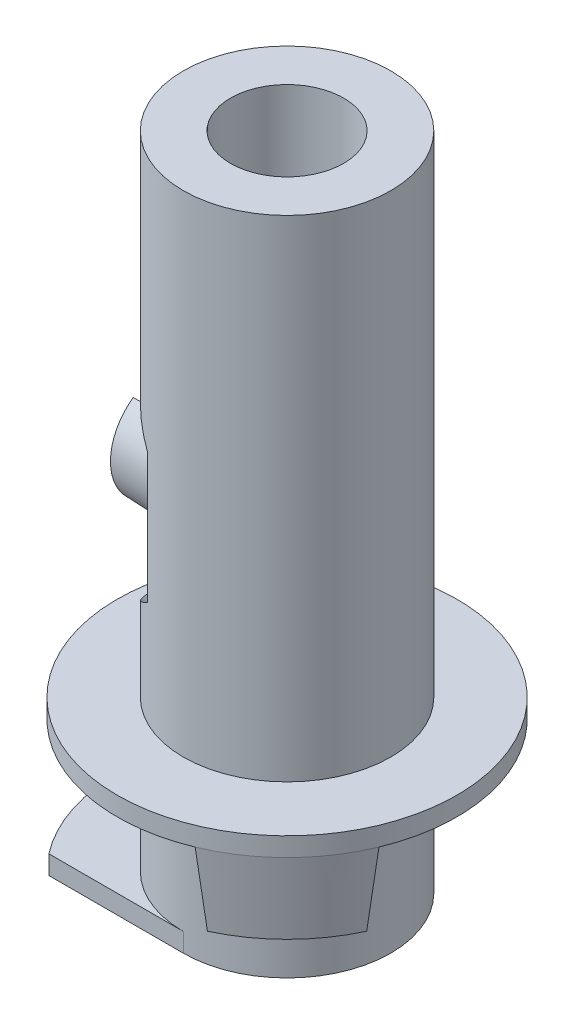
ISO-10303-21;
HEADER;
FILE_DESCRIPTION(('STEP AP214'),'2;1');
FILE_NAME('part.step','',(''),(''),'','','');
FILE_SCHEMA(('AUTOMOTIVE_DESIGN { 1 0 10303 214 1 1 1 1 }'));
ENDSEC;
DATA;
#1=APPLICATION_CONTEXT('core data for automotive mechanical design processes');
#2=APPLICATION_PROTOCOL_DEFINITION('international standard','automotive_design',2000,#1);
#3=PRODUCT_CONTEXT('',#1,'mechanical');
#4=PRODUCT('Part','Part','',(#3));
#5=PRODUCT_RELATED_PRODUCT_CATEGORY('part','',(#4));
#6=PRODUCT_DEFINITION_FORMATION('','',#4);
#7=PRODUCT_DEFINITION_CONTEXT('part definition',#1,'design');
#8=PRODUCT_DEFINITION('design','',#6,#7);
#9=PRODUCT_DEFINITION_SHAPE('','',#8);
#10=(LENGTH_UNIT() NAMED_UNIT(*) SI_UNIT(.MILLI.,.METRE.));
#11=(NAMED_UNIT(*) PLANE_ANGLE_UNIT() SI_UNIT($,.RADIAN.));
#12=(NAMED_UNIT(*) SI_UNIT($,.STERADIAN.) SOLID_ANGLE_UNIT());
#13=UNCERTAINTY_MEASURE_WITH_UNIT(LENGTH_MEASURE(1.E-05),#10,'distance_accuracy_value','');
#14=(GEOMETRIC_REPRESENTATION_CONTEXT(3) GLOBAL_UNCERTAINTY_ASSIGNED_CONTEXT((#13)) GLOBAL_UNIT_ASSIGNED_CONTEXT((#10,
#11,#12)) REPRESENTATION_CONTEXT('',''));
#15=CARTESIAN_POINT('',(0.,0.,0.));
#16=DIRECTION('',(0.,0.,1.));
#17=DIRECTION('',(1.,0.,0.));
#18=AXIS2_PLACEMENT_3D('',#15,#16,#17);
#19=CARTESIAN_POINT('',(-1.25,9.,0.));
#20=DIRECTION('',(1.,0.,0.));
#21=DIRECTION('',(0.,0.,1.));
#22=AXIS2_PLACEMENT_3D('',#19,#20,#21);
#23=CONICAL_SURFACE('',#22,1.5,0.0349065850398867);
#24=CARTESIAN_POINT('',(-3.25,9.,0.));
#25=DIRECTION('',(-1.,0.,0.));
#26=DIRECTION('',(0.,0.,1.));
#27=AXIS2_PLACEMENT_3D('',#24,#25,#26);
#28=CIRCLE('',#27,1.4301584610165);
#29=CARTESIAN_POINT('',(-3.25,7.83473040732324,0.829156197588875));
#30=VERTEX_POINT('',#29);
#31=CARTESIAN_POINT('',(-3.25,10.1652695926768,0.829156197588875));
#32=VERTEX_POINT('',#31);
#33=EDGE_CURVE('E297',#30,#32,#28,.T.);
#34=ORIENTED_EDGE('',*,*,#33,.F.);
#35=CARTESIAN_POINT('',(-5.54773311647972,7.93473777492102,0.829156197588875));
#36=CARTESIAN_POINT('',(-5.0819546412354,7.91412855667914,0.829156197588875));
#37=CARTESIAN_POINT('',(-4.61616648000731,7.89373944782878,0.829156197588875));
#38=CARTESIAN_POINT('',(-3.68457380835907,7.85334350231108,0.829156197588875));
#39=CARTESIAN_POINT('',(-3.21876929794726,7.83333666545131,0.829156197588875));
#40=CARTESIAN_POINT('',(-2.28714654622157,7.79364729942847,0.829156197588875));
#41=CARTESIAN_POINT('',(-1.82132830490961,7.77396477022052,0.829156197588875));
#42=CARTESIAN_POINT('',(-0.889679729064266,7.73488229903319,0.829156197588875));
#43=CARTESIAN_POINT('',(-0.423849394524931,7.71548235719585,0.829156197588875));
#44=CARTESIAN_POINT('',(0.0419859014446088,7.69620286008843,0.829156197588875));
#45=B_SPLINE_CURVE_WITH_KNOTS('',3,(#35,#36,#37,#38,#39,#40,#41,#42,#43,#44),.UNSPECIFIED.,.F.,
.F.,(4,2,2,2,4),(0.,1.39870246719932,2.79740423027038,4.19610579972534,5.59480807211741),.UNSPECIFIED.);
#46=CARTESIAN_POINT('',(-1.25,7.75000000000002,0.829156197588874));
#47=VERTEX_POINT('',#46);
#48=EDGE_CURVE('E260',#30,#47,#45,.T.);
#49=ORIENTED_EDGE('',*,*,#48,.T.);
#50=CARTESIAN_POINT('',(-1.25,9.,0.));
#51=DIRECTION('',(1.,0.,0.));
#52=DIRECTION('',(0.,0.,-1.));
#53=AXIS2_PLACEMENT_3D('',#50,#51,#52);
#54=CIRCLE('',#53,1.5);
#55=CARTESIAN_POINT('',(-1.25,10.25,0.829156197588874));
#56=VERTEX_POINT('',#55);
#57=EDGE_CURVE('E160',#47,#56,#54,.F.);
#58=ORIENTED_EDGE('',*,*,#57,.T.);
#59=CARTESIAN_POINT('',(0.0419859014446088,10.3037971399116,0.829156197588875));
#60=CARTESIAN_POINT('',(-0.423849394524932,10.2845176428042,0.829156197588875));
#61=CARTESIAN_POINT('',(-0.889679729064267,10.2651177009668,0.829156197588875));
#62=CARTESIAN_POINT('',(-1.8213283049096,10.2260352297795,0.829156197588875));
#63=CARTESIAN_POINT('',(-2.28714654622157,10.2063527005715,0.829156197588875));
#64=CARTESIAN_POINT('',(-3.21876929794725,10.1666633345486,0.829156197588875));
#65=CARTESIAN_POINT('',(-3.68457380835907,10.1466564976889,0.829156197588875));
#66=CARTESIAN_POINT('',(-4.61616648000731,10.1062605521713,0.829156197588875));
#67=CARTESIAN_POINT('',(-5.0819546412354,10.0858714433209,0.829156197588875));
#68=CARTESIAN_POINT('',(-5.54773311647972,10.065262225079,0.829156197588875));
#69=B_SPLINE_CURVE_WITH_KNOTS('',3,(#59,#60,#61,#62,#63,#64,#65,#66,#67,#68),.UNSPECIFIED.,.F.,
.F.,(4,2,2,2,4),(0.,1.39870227239207,2.79740384184703,4.19610560491809,5.59480807211741),.UNSPECIFIED.);
#70=EDGE_CURVE('E275',#56,#32,#69,.T.);
#71=ORIENTED_EDGE('',*,*,#70,.T.);
#72=EDGE_LOOP('',(#34,#49,#58,#71));
#73=FACE_BOUND('',#72,.T.);
#74=ADVANCED_FACE('F37',(#73),#23,.T.);
#75=CARTESIAN_POINT('',(-3.25,9.,0.));
#76=DIRECTION('',(-1.,0.,0.));
#77=DIRECTION('',(0.,0.,1.));
#78=AXIS2_PLACEMENT_3D('',#75,#76,#77);
#79=PLANE('',#78);
#80=DIRECTION('',(0.,1.,0.));
#81=VECTOR('',#80,1.);
#82=CARTESIAN_POINT('',(-3.25,10.4912697922836,0.829156197588875));
#83=LINE('',#82,#81);
#84=EDGE_CURVE('E168',#30,#32,#83,.T.);
#85=ORIENTED_EDGE('',*,*,#84,.F.);
#86=ORIENTED_EDGE('',*,*,#33,.T.);
#87=EDGE_LOOP('',(#85,#86));
#88=FACE_BOUND('',#87,.T.);
#89=ADVANCED_FACE('F254',(#88),#79,.T.);
#90=CARTESIAN_POINT('',(-1.25,9.,0.));
#91=DIRECTION('',(1.,0.,0.));
#92=DIRECTION('',(0.,0.,-1.));
#93=AXIS2_PLACEMENT_3D('',#90,#91,#92);
#94=PLANE('',#93);
#95=CARTESIAN_POINT('',(-1.25,9.,0.));
#96=DIRECTION('',(1.,0.,0.));
#97=DIRECTION('',(0.,0.,-1.));
#98=AXIS2_PLACEMENT_3D('',#95,#96,#97);
#99=CIRCLE('',#98,3.);
#100=CARTESIAN_POINT('',(-1.25,6.11685935133231,-0.829156197588875));
#101=VERTEX_POINT('',#100);
#102=CARTESIAN_POINT('',(-1.25,7.26794919243112,-2.44948974278318));
#103=VERTEX_POINT('',#102);
#104=EDGE_CURVE('E300',#101,#103,#99,.T.);
#105=ORIENTED_EDGE('',*,*,#104,.F.);
#106=DIRECTION('',(0.,1.,0.));
#107=VECTOR('',#106,1.);
#108=CARTESIAN_POINT('',(-1.25,17.5,-0.829156197588875));
#109=LINE('',#108,#107);
#110=CARTESIAN_POINT('',(-1.25,7.75000000000002,-0.829156197588874));
#111=VERTEX_POINT('',#110);
#112=EDGE_CURVE('E182',#101,#111,#109,.T.);
#113=ORIENTED_EDGE('',*,*,#112,.T.);
#114=CARTESIAN_POINT('',(-1.25,10.25,-0.829156197588875));
#115=VERTEX_POINT('',#114);
#116=EDGE_CURVE('E165',#115,#111,#54,.F.);
#117=ORIENTED_EDGE('',*,*,#116,.F.);
#118=CARTESIAN_POINT('',(-1.25,11.8831406486677,-0.829156197588875));
#119=VERTEX_POINT('',#118);
#120=EDGE_CURVE('E171',#115,#119,#109,.T.);
#121=ORIENTED_EDGE('',*,*,#120,.T.);
#122=CARTESIAN_POINT('',(-1.25,10.7320508075689,-2.44948974278318));
#123=VERTEX_POINT('',#122);
#124=EDGE_CURVE('E302',#123,#119,#99,.T.);
#125=ORIENTED_EDGE('',*,*,#124,.F.);
#126=DIRECTION('',(0.,1.,0.));
#127=VECTOR('',#126,1.);
#128=CARTESIAN_POINT('',(-1.25,0.,-2.44948974278318));
#129=LINE('',#128,#127);
#130=EDGE_CURVE('E185',#123,#103,#129,.F.);
#131=ORIENTED_EDGE('',*,*,#130,.T.);
#132=EDGE_LOOP('',(#105,#113,#117,#121,#125,#131));
#133=FACE_BOUND('',#132,.T.);
#134=ADVANCED_FACE('F184',(#133),#94,.F.);
#135=CARTESIAN_POINT('',(0.,0.,0.));
#136=DIRECTION('',(0.,1.,0.));
#137=DIRECTION('',(0.,0.,1.));
#138=AXIS2_PLACEMENT_3D('',#135,#136,#137);
#139=CYLINDRICAL_SURFACE('',#138,2.75);
#140=CARTESIAN_POINT('',(0.,4.5,0.));
#141=DIRECTION('',(0.,1.,0.));
#142=DIRECTION('',(0.,0.,1.));
#143=AXIS2_PLACEMENT_3D('',#140,#141,#142);
#144=CIRCLE('',#143,2.75);
#145=CARTESIAN_POINT('',(0.,4.5,2.75));
#146=VERTEX_POINT('',#145);
#147=EDGE_CURVE('E400',#146,#146,#144,.T.);
#148=ORIENTED_EDGE('',*,*,#147,.T.);
#149=EDGE_LOOP('',(#148));
#150=FACE_BOUND('',#149,.T.);
#151=CARTESIAN_POINT('',(0.,17.5,0.));
#152=DIRECTION('',(0.,1.,0.));
#153=DIRECTION('',(0.,0.,1.));
#154=AXIS2_PLACEMENT_3D('',#151,#152,#153);
#155=CIRCLE('',#154,2.75);
#156=CARTESIAN_POINT('',(0.,17.5,2.75));
#157=VERTEX_POINT('',#156);
#158=EDGE_CURVE('E397',#157,#157,#155,.T.);
#159=ORIENTED_EDGE('',*,*,#158,.F.);
#160=EDGE_LOOP('',(#159));
#161=FACE_BOUND('',#160,.T.);
#162=DIRECTION('',(0.,1.,0.));
#163=VECTOR('',#162,1.);
#164=CARTESIAN_POINT('',(-1.25,0.,2.44948974278318));
#165=LINE('',#164,#163);
#166=CARTESIAN_POINT('',(-1.25,7.26794919243112,2.44948974278318));
#167=VERTEX_POINT('',#166);
#168=CARTESIAN_POINT('',(-1.25,10.7320508075689,2.44948974278318));
#169=VERTEX_POINT('',#168);
#170=EDGE_CURVE('E189',#167,#169,#165,.T.);
#171=ORIENTED_EDGE('',*,*,#170,.F.);
#172=CARTESIAN_POINT('',(-1.25,7.26794919243112,2.44948974278318));
#173=CARTESIAN_POINT('',(-1.29360109122252,7.2364696803024,2.42723370605396));
#174=CARTESIAN_POINT('',(-1.33646886510283,7.20475799307902,2.40389651947983));
#175=CARTESIAN_POINT('',(-1.42079406110998,7.14113488651769,2.3550425596927));
#176=CARTESIAN_POINT('',(-1.46225143542518,7.10922346045204,2.32952571269335));
#177=CARTESIAN_POINT('',(-1.58476880063755,7.01344845542112,2.24956414252169));
#178=CARTESIAN_POINT('',(-1.66378122565755,6.94968605273935,2.19180688198788));
#179=CARTESIAN_POINT('',(-1.81702758225269,6.82349126438266,2.0665931907894));
#180=CARTESIAN_POINT('',(-1.89119688384546,6.76108227953949,1.99903384009693));
#181=CARTESIAN_POINT('',(-2.03304768513551,6.64003791929434,1.85457545287197));
#182=CARTESIAN_POINT('',(-2.10073693795824,6.5813980626076,1.7776878335623));
#183=CARTESIAN_POINT('',(-2.2437629753308,6.45628131822538,1.59513202237854));
#184=CARTESIAN_POINT('',(-2.31716105500053,6.39119926644495,1.48694582598197));
#185=CARTESIAN_POINT('',(-2.4495919360588,6.27289087512397,1.25678641241698));
#186=CARTESIAN_POINT('',(-2.50868654695825,6.21961361129784,1.13487597762832));
#187=CARTESIAN_POINT('',(-2.60160008584873,6.13547562958644,0.898700751629193));
#188=CARTESIAN_POINT('',(-2.63792574141932,6.102412920861,0.786218291272837));
#189=CARTESIAN_POINT('',(-2.69615354404084,6.04930512371971,0.554527089967231));
#190=CARTESIAN_POINT('',(-2.71805522743689,6.02926045376564,0.435318132930186));
#191=CARTESIAN_POINT('',(-2.74593654373312,6.00372973635978,0.193008267367081));
#192=CARTESIAN_POINT('',(-2.75185509064452,5.9982995442849,0.0698942414795929));
#193=CARTESIAN_POINT('',(-2.7471263477659,6.00263412336194,-0.175739129092036));
#194=CARTESIAN_POINT('',(-2.73647965557244,6.01239834637023,-0.298258495068787));
#195=CARTESIAN_POINT('',(-2.70068581757648,6.04514694657188,-0.530773316301527));
#196=CARTESIAN_POINT('',(-2.67654827663599,6.06721060697073,-0.641060215336326));
#197=CARTESIAN_POINT('',(-2.61600950057989,6.12235327958093,-0.855212543567005));
#198=CARTESIAN_POINT('',(-2.57961092441018,6.15542990348703,-0.9590793592566));
#199=CARTESIAN_POINT('',(-2.48193315354928,6.24374973693234,-1.19316274162378));
#200=CARTESIAN_POINT('',(-2.41640215513245,6.30270470027457,-1.32020146609323));
#201=CARTESIAN_POINT('',(-2.26995725539269,6.43307983993419,-1.55869354370602));
#202=CARTESIAN_POINT('',(-2.18896921778365,6.50455994919897,-1.67006709749393));
#203=CARTESIAN_POINT('',(-2.04096855220335,6.63311514872375,-1.84550620876404));
#204=CARTESIAN_POINT('',(-1.97701266924504,6.68811107455905,-1.91376275908749));
#205=CARTESIAN_POINT('',(-1.84379788137059,6.80094742095163,-2.04242312424064));
#206=CARTESIAN_POINT('',(-1.77453489426201,6.85879001866764,-2.10282079574128));
#207=CARTESIAN_POINT('',(-1.63201311321895,6.97532840604242,-2.21521483621865));
#208=CARTESIAN_POINT('',(-1.55881051505756,7.03400630965185,-2.26730118708306));
#209=CARTESIAN_POINT('',(-1.44559674452185,7.12205138923085,-2.33981901171704));
#210=CARTESIAN_POINT('',(-1.40731965955976,7.1513830545826,-2.36304144286291));
#211=CARTESIAN_POINT('',(-1.32956877566832,7.20985914790689,-2.40764422011553));
#212=CARTESIAN_POINT('',(-1.29009498536312,7.23900357722692,-2.42902457949307));
#213=CARTESIAN_POINT('',(-1.25,7.26794919243112,-2.44948974278318));
#214=B_SPLINE_CURVE_WITH_KNOTS('',3,(#172,#173,#174,#175,#176,#177,#178,#179,#180,#181,#182,
#183,#184,#185,#186,#187,#188,#189,#190,#191,#192,#193,#194,#195,#196,#197,#198,#199,#200,#201,
#202,#203,#204,#205,#206,#207,#208,#209,#210,#211,#212,#213),.UNSPECIFIED.,.F.,.F.,(4,2,2,2,2,2,
2,2,2,2,2,2,2,2,2,2,2,2,2,2,4),(0.,0.174568213691818,0.349142339249726,0.699064440548584,
1.05296962740488,1.40644594512683,1.8429560716287,2.27754481307969,2.64422002069884,
3.0109070144231,3.37899347977766,3.74706666659737,4.09070363541296,4.43426613054111,
4.89563979561709,5.35928462980441,5.68436721994048,6.00970242151493,6.33123332010189,
6.49176482445276,6.65229517219497),.UNSPECIFIED.);
#215=EDGE_CURVE('E52',#167,#103,#214,.T.);
#216=ORIENTED_EDGE('',*,*,#215,.T.);
#217=ORIENTED_EDGE('',*,*,#130,.F.);
#218=CARTESIAN_POINT('',(-1.25,10.7320508075689,-2.44948974278318));
#219=CARTESIAN_POINT('',(-1.29360109122252,10.7635303196976,-2.42723370605396));
#220=CARTESIAN_POINT('',(-1.33646886510283,10.795242006921,-2.40389651947983));
#221=CARTESIAN_POINT('',(-1.42079406110999,10.8588651134823,-2.3550425596927));
#222=CARTESIAN_POINT('',(-1.46225143542518,10.890776539548,-2.32952571269335));
#223=CARTESIAN_POINT('',(-1.58476880063756,10.9865515445789,-2.24956414252169));
#224=CARTESIAN_POINT('',(-1.66378122565755,11.0503139472607,-2.19180688198788));
#225=CARTESIAN_POINT('',(-1.81702758225269,11.1765087356173,-2.0665931907894));
#226=CARTESIAN_POINT('',(-1.89119688384546,11.2389177204605,-1.99903384009693));
#227=CARTESIAN_POINT('',(-2.03304768513551,11.3599620807057,-1.85457545287197));
#228=CARTESIAN_POINT('',(-2.10073693795824,11.4186019373924,-1.7776878335623));
#229=CARTESIAN_POINT('',(-2.2437629753308,11.5437186817746,-1.59513202237854));
#230=CARTESIAN_POINT('',(-2.31716105500053,11.608800733555,-1.48694582598197));
#231=CARTESIAN_POINT('',(-2.4495919360588,11.727109124876,-1.25678641241698));
#232=CARTESIAN_POINT('',(-2.50868654695825,11.7803863887022,-1.13487597762832));
#233=CARTESIAN_POINT('',(-2.60160008584873,11.8645243704136,-0.898700751629194));
#234=CARTESIAN_POINT('',(-2.63792574141932,11.897587079139,-0.786218291272839));
#235=CARTESIAN_POINT('',(-2.69615354404084,11.9506948762803,-0.554527089967233));
#236=CARTESIAN_POINT('',(-2.71805522743689,11.9707395462344,-0.435318132930187));
#237=CARTESIAN_POINT('',(-2.74593654373312,11.9962702636402,-0.193008267367082));
#238=CARTESIAN_POINT('',(-2.75185509064452,12.0017004557151,-0.0698942414795941));
#239=CARTESIAN_POINT('',(-2.7471263477659,11.9973658766381,0.175739129092035));
#240=CARTESIAN_POINT('',(-2.73647965557244,11.9876016536298,0.298258495068786));
#241=CARTESIAN_POINT('',(-2.70068581757648,11.9548530534281,0.530773316301526));
#242=CARTESIAN_POINT('',(-2.67654827663599,11.9327893930293,0.641060215336325));
#243=CARTESIAN_POINT('',(-2.61600950057989,11.8776467204191,0.855212543567004));
#244=CARTESIAN_POINT('',(-2.57961092441018,11.844570096513,0.9590793592566));
#245=CARTESIAN_POINT('',(-2.48193315354928,11.7562502630677,1.19316274162378));
#246=CARTESIAN_POINT('',(-2.41640215513245,11.6972952997254,1.32020146609323));
#247=CARTESIAN_POINT('',(-2.26995725539269,11.5669201600658,1.55869354370602));
#248=CARTESIAN_POINT('',(-2.18896921778365,11.495440050801,1.67006709749393));
#249=CARTESIAN_POINT('',(-2.04096855220335,11.3668848512763,1.84550620876404));
#250=CARTESIAN_POINT('',(-1.97701266924504,11.311888925441,1.91376275908749));
#251=CARTESIAN_POINT('',(-1.84379788137059,11.1990525790484,2.04242312424064));
#252=CARTESIAN_POINT('',(-1.77453489426201,11.1412099813324,2.10282079574128));
#253=CARTESIAN_POINT('',(-1.63201311321894,11.0246715939576,2.21521483621865));
#254=CARTESIAN_POINT('',(-1.55881051505756,10.9659936903482,2.26730118708306));
#255=CARTESIAN_POINT('',(-1.44559674452185,10.8779486107692,2.33981901171704));
#256=CARTESIAN_POINT('',(-1.40731965955976,10.8486169454174,2.36304144286291));
#257=CARTESIAN_POINT('',(-1.32956877566832,10.7901408520931,2.40764422011554));
#258=CARTESIAN_POINT('',(-1.29009498536312,10.7609964227731,2.42902457949307));
#259=CARTESIAN_POINT('',(-1.25,10.7320508075689,2.44948974278318));
#260=B_SPLINE_CURVE_WITH_KNOTS('',3,(#218,#219,#220,#221,#222,#223,#224,#225,#226,#227,#228,
#229,#230,#231,#232,#233,#234,#235,#236,#237,#238,#239,#240,#241,#242,#243,#244,#245,#246,#247,
#248,#249,#250,#251,#252,#253,#254,#255,#256,#257,#258,#259),.UNSPECIFIED.,.F.,.F.,(4,2,2,2,2,2,
2,2,2,2,2,2,2,2,2,2,2,2,2,2,4),(0.,0.174568213691819,0.349142339249726,0.699064440548583,
1.05296962740487,1.40644594512683,1.8429560716287,2.27754481307969,2.64422002069884,
3.0109070144231,3.37899347977766,3.74706666659736,4.09070363541296,4.43426613054111,
4.89563979561709,5.35928462980441,5.68436721994047,6.00970242151493,6.33123332010189,
6.49176482445276,6.65229517219497),.UNSPECIFIED.);
#261=EDGE_CURVE('E200',#123,#169,#260,.T.);
#262=ORIENTED_EDGE('',*,*,#261,.T.);
#263=EDGE_LOOP('',(#171,#216,#217,#262));
#264=FACE_BOUND('',#263,.T.);
#265=ADVANCED_FACE('F205',(#150,#161,#264),#139,.T.);
#266=CARTESIAN_POINT('',(4.5,4.,0.));
#267=DIRECTION('',(0.,1.,0.));
#268=DIRECTION('',(0.,0.,1.));
#269=AXIS2_PLACEMENT_3D('',#266,#267,#268);
#270=PLANE('',#269);
#271=CARTESIAN_POINT('',(0.,4.,0.));
#272=DIRECTION('',(0.,-1.,0.));
#273=DIRECTION('',(0.,0.,-1.));
#274=AXIS2_PLACEMENT_3D('',#271,#272,#273);
#275=CIRCLE('',#274,2.75);
#276=CARTESIAN_POINT('',(0.,4.,-2.75));
#277=VERTEX_POINT('',#276);
#278=EDGE_CURVE('E390',#277,#277,#275,.T.);
#279=ORIENTED_EDGE('',*,*,#278,.F.);
#280=EDGE_LOOP('',(#279));
#281=FACE_BOUND('',#280,.T.);
#282=DIRECTION('',(-0.382683432365124,0.,-0.923879532511273));
#283=VECTOR('',#282,1.);
#284=CARTESIAN_POINT('',(1.33939201327794,4.,3.23357836378945));
#285=LINE('',#284,#283);
#286=CARTESIAN_POINT('',(1.72207544564306,4.,4.15745789630073));
#287=VERTEX_POINT('',#286);
#288=CARTESIAN_POINT('',(1.33939201327793,4.,3.23357836378945));
#289=VERTEX_POINT('',#288);
#290=EDGE_CURVE('E304',#287,#289,#285,.T.);
#291=ORIENTED_EDGE('',*,*,#290,.F.);
#292=CARTESIAN_POINT('',(0.,4.,0.));
#293=DIRECTION('',(0.,-1.,0.));
#294=DIRECTION('',(0.,0.,-1.));
#295=AXIS2_PLACEMENT_3D('',#292,#293,#294);
#296=CIRCLE('',#295,4.5);
#297=CARTESIAN_POINT('',(4.15745789630086,4.,1.72207544564274));
#298=VERTEX_POINT('',#297);
#299=EDGE_CURVE('E393',#287,#298,#296,.T.);
#300=ORIENTED_EDGE('',*,*,#299,.T.);
#301=DIRECTION('',(0.923879532511301,0.,0.382683432365054));
#302=VECTOR('',#301,1.);
#303=CARTESIAN_POINT('',(3.23357836378955,4.,1.33939201327769));
#304=LINE('',#303,#302);
#305=CARTESIAN_POINT('',(3.23357836378955,4.,1.33939201327769));
#306=VERTEX_POINT('',#305);
#307=EDGE_CURVE('E309',#306,#298,#304,.T.);
#308=ORIENTED_EDGE('',*,*,#307,.F.);
#309=CARTESIAN_POINT('',(0.,4.,0.));
#310=DIRECTION('',(0.,1.,0.));
#311=DIRECTION('',(0.,0.,-1.));
#312=AXIS2_PLACEMENT_3D('',#309,#310,#311);
#313=CIRCLE('',#312,3.5);
#314=EDGE_CURVE('E60',#289,#306,#313,.T.);
#315=ORIENTED_EDGE('',*,*,#314,.F.);
#316=EDGE_LOOP('',(#291,#300,#308,#315));
#317=FACE_BOUND('',#316,.T.);
#318=ADVANCED_FACE('F448',(#281,#317),#270,.F.);
#319=CARTESIAN_POINT('',(0.,17.5,0.));
#320=DIRECTION('',(0.,-1.,0.));
#321=DIRECTION('',(0.,0.,-1.));
#322=AXIS2_PLACEMENT_3D('',#319,#320,#321);
#323=CYLINDRICAL_SURFACE('',#322,4.5);
#324=EDGE_CURVE('E394',#298,#287,#296,.T.);
#325=ORIENTED_EDGE('',*,*,#324,.F.);
#326=ORIENTED_EDGE('',*,*,#299,.F.);
#327=EDGE_LOOP('',(#325,#326));
#328=FACE_BOUND('',#327,.T.);
#329=CARTESIAN_POINT('',(0.,4.5,0.));
#330=DIRECTION('',(0.,1.,0.));
#331=DIRECTION('',(0.,0.,1.));
#332=AXIS2_PLACEMENT_3D('',#329,#330,#331);
#333=CIRCLE('',#332,4.5);
#334=CARTESIAN_POINT('',(0.,4.5,4.5));
#335=VERTEX_POINT('',#334);
#336=EDGE_CURVE('E403',#335,#335,#333,.T.);
#337=ORIENTED_EDGE('',*,*,#336,.F.);
#338=EDGE_LOOP('',(#337));
#339=FACE_BOUND('',#338,.T.);
#340=ADVANCED_FACE('F454',(#328,#339),#323,.T.);
#341=CARTESIAN_POINT('',(4.5,4.5,0.));
#342=DIRECTION('',(0.,1.,0.));
#343=DIRECTION('',(0.,0.,1.));
#344=AXIS2_PLACEMENT_3D('',#341,#342,#343);
#345=PLANE('',#344);
#346=ORIENTED_EDGE('',*,*,#336,.T.);
#347=EDGE_LOOP('',(#346));
#348=FACE_BOUND('',#347,.T.);
#349=ORIENTED_EDGE('',*,*,#147,.F.);
#350=EDGE_LOOP('',(#349));
#351=FACE_BOUND('',#350,.T.);
#352=ADVANCED_FACE('F443',(#348,#351),#345,.T.);
#353=CARTESIAN_POINT('',(0.,17.5,0.));
#354=DIRECTION('',(0.,1.,0.));
#355=DIRECTION('',(0.,0.,1.));
#356=AXIS2_PLACEMENT_3D('',#353,#354,#355);
#357=PLANE('',#356);
#358=CARTESIAN_POINT('',(0.,17.5,0.));
#359=DIRECTION('',(0.,1.,0.));
#360=DIRECTION('',(0.,0.,1.));
#361=AXIS2_PLACEMENT_3D('',#358,#359,#360);
#362=CIRCLE('',#361,1.50000000000002);
#363=CARTESIAN_POINT('',(0.,17.5,1.50000000000002));
#364=VERTEX_POINT('',#363);
#365=EDGE_CURVE('E425',#364,#364,#362,.T.);
#366=ORIENTED_EDGE('',*,*,#365,.F.);
#367=EDGE_LOOP('',(#366));
#368=FACE_BOUND('',#367,.T.);
#369=ORIENTED_EDGE('',*,*,#158,.T.);
#370=EDGE_LOOP('',(#369));
#371=FACE_BOUND('',#370,.T.);
#372=ADVANCED_FACE('F439',(#368,#371),#357,.T.);
#373=CARTESIAN_POINT('',(0.,0.,0.));
#374=DIRECTION('',(0.,-1.,0.));
#375=DIRECTION('',(0.,0.,-1.));
#376=AXIS2_PLACEMENT_3D('',#373,#374,#375);
#377=CYLINDRICAL_SURFACE('',#376,2.75);
#378=CARTESIAN_POINT('',(0.,0.5,0.));
#379=DIRECTION('',(0.,-1.,0.));
#380=DIRECTION('',(0.,0.,-1.));
#381=AXIS2_PLACEMENT_3D('',#378,#379,#380);
#382=CIRCLE('',#381,2.75);
#383=CARTESIAN_POINT('',(0.,0.5,2.75));
#384=VERTEX_POINT('',#383);
#385=CARTESIAN_POINT('',(0.,0.5,-2.75));
#386=VERTEX_POINT('',#385);
#387=EDGE_CURVE('E387',#384,#386,#382,.T.);
#388=ORIENTED_EDGE('',*,*,#387,.F.);
#389=DIRECTION('',(0.,-1.,0.));
#390=VECTOR('',#389,1.);
#391=CARTESIAN_POINT('',(0.,12.5828417770715,2.75));
#392=LINE('',#391,#390);
#393=CARTESIAN_POINT('',(0.,0.,2.75));
#394=VERTEX_POINT('',#393);
#395=EDGE_CURVE('E367',#384,#394,#392,.T.);
#396=ORIENTED_EDGE('',*,*,#395,.T.);
#397=CARTESIAN_POINT('',(0.,0.,0.));
#398=DIRECTION('',(0.,1.,0.));
#399=DIRECTION('',(0.,0.,-1.));
#400=AXIS2_PLACEMENT_3D('',#397,#398,#399);
#401=CIRCLE('',#400,2.75);
#402=CARTESIAN_POINT('',(0.,0.,-2.75));
#403=VERTEX_POINT('',#402);
#404=EDGE_CURVE('E320',#394,#403,#401,.T.);
#405=ORIENTED_EDGE('',*,*,#404,.T.);
#406=DIRECTION('',(0.,-1.,0.));
#407=VECTOR('',#406,1.);
#408=CARTESIAN_POINT('',(0.,12.5828417770715,-2.75));
#409=LINE('',#408,#407);
#410=EDGE_CURVE('E375',#386,#403,#409,.T.);
#411=ORIENTED_EDGE('',*,*,#410,.F.);
#412=EDGE_LOOP('',(#388,#396,#405,#411));
#413=FACE_BOUND('',#412,.T.);
#414=ORIENTED_EDGE('',*,*,#278,.T.);
#415=EDGE_LOOP('',(#414));
#416=FACE_BOUND('',#415,.T.);
#417=ADVANCED_FACE('F442',(#413,#416),#377,.T.);
#418=CARTESIAN_POINT('',(4.5,0.5,0.));
#419=DIRECTION('',(0.,-1.,0.));
#420=DIRECTION('',(0.,0.,-1.));
#421=AXIS2_PLACEMENT_3D('',#418,#419,#420);
#422=PLANE('',#421);
#423=CARTESIAN_POINT('',(0.,0.5,0.));
#424=DIRECTION('',(0.,-1.,0.));
#425=DIRECTION('',(0.,0.,-1.));
#426=AXIS2_PLACEMENT_3D('',#423,#424,#425);
#427=CIRCLE('',#426,4.5);
#428=CARTESIAN_POINT('',(-3.56195171219375,0.5,2.75));
#429=VERTEX_POINT('',#428);
#430=CARTESIAN_POINT('',(-3.56195171219375,0.5,-2.75));
#431=VERTEX_POINT('',#430);
#432=EDGE_CURVE('E384',#429,#431,#427,.T.);
#433=ORIENTED_EDGE('',*,*,#432,.F.);
#434=DIRECTION('',(-1.,0.,0.));
#435=VECTOR('',#434,1.);
#436=CARTESIAN_POINT('',(0.,0.5,2.75));
#437=LINE('',#436,#435);
#438=EDGE_CURVE('E364',#384,#429,#437,.T.);
#439=ORIENTED_EDGE('',*,*,#438,.F.);
#440=ORIENTED_EDGE('',*,*,#387,.T.);
#441=DIRECTION('',(1.,0.,0.));
#442=VECTOR('',#441,1.);
#443=CARTESIAN_POINT('',(0.,0.5,-2.75));
#444=LINE('',#443,#442);
#445=EDGE_CURVE('E366',#431,#386,#444,.T.);
#446=ORIENTED_EDGE('',*,*,#445,.F.);
#447=EDGE_LOOP('',(#433,#439,#440,#446));
#448=FACE_BOUND('',#447,.T.);
#449=ADVANCED_FACE('F466',(#448),#422,.F.);
#450=CARTESIAN_POINT('',(0.,0.,0.));
#451=DIRECTION('',(0.,1.,0.));
#452=DIRECTION('',(0.,0.,1.));
#453=AXIS2_PLACEMENT_3D('',#450,#451,#452);
#454=PLANE('',#453);
#455=CARTESIAN_POINT('',(0.,0.,0.));
#456=DIRECTION('',(0.,1.,0.));
#457=DIRECTION('',(0.,0.,1.));
#458=AXIS2_PLACEMENT_3D('',#455,#456,#457);
#459=CIRCLE('',#458,1.00000000000001);
#460=CARTESIAN_POINT('',(0.,0.,1.00000000000001));
#461=VERTEX_POINT('',#460);
#462=EDGE_CURVE('E419',#461,#461,#459,.T.);
#463=ORIENTED_EDGE('',*,*,#462,.T.);
#464=EDGE_LOOP('',(#463));
#465=FACE_BOUND('',#464,.T.);
#466=ORIENTED_EDGE('',*,*,#404,.F.);
#467=DIRECTION('',(1.,0.,0.));
#468=VECTOR('',#467,1.);
#469=CARTESIAN_POINT('',(0.,0.,2.75));
#470=LINE('',#469,#468);
#471=CARTESIAN_POINT('',(-3.56195171219375,0.,2.75));
#472=VERTEX_POINT('',#471);
#473=EDGE_CURVE('E372',#472,#394,#470,.T.);
#474=ORIENTED_EDGE('',*,*,#473,.F.);
#475=CARTESIAN_POINT('',(0.,0.,0.));
#476=DIRECTION('',(0.,1.,0.));
#477=DIRECTION('',(0.,0.,1.));
#478=AXIS2_PLACEMENT_3D('',#475,#476,#477);
#479=CIRCLE('',#478,4.5);
#480=CARTESIAN_POINT('',(-3.56195171219375,0.,-2.75));
#481=VERTEX_POINT('',#480);
#482=EDGE_CURVE('E405',#481,#472,#479,.T.);
#483=ORIENTED_EDGE('',*,*,#482,.F.);
#484=DIRECTION('',(-1.,0.,0.));
#485=VECTOR('',#484,1.);
#486=CARTESIAN_POINT('',(0.,0.,-2.75));
#487=LINE('',#486,#485);
#488=EDGE_CURVE('E370',#403,#481,#487,.T.);
#489=ORIENTED_EDGE('',*,*,#488,.F.);
#490=EDGE_LOOP('',(#466,#474,#483,#489));
#491=FACE_BOUND('',#490,.T.);
#492=ADVANCED_FACE('F464',(#465,#491),#454,.F.);
#493=ORIENTED_EDGE('',*,*,#482,.T.);
#494=DIRECTION('',(0.,-1.,0.));
#495=VECTOR('',#494,1.);
#496=CARTESIAN_POINT('',(-3.56195171219375,12.5828417770715,2.75));
#497=LINE('',#496,#495);
#498=EDGE_CURVE('E377',#429,#472,#497,.T.);
#499=ORIENTED_EDGE('',*,*,#498,.F.);
#500=ORIENTED_EDGE('',*,*,#432,.T.);
#501=DIRECTION('',(0.,-1.,0.));
#502=VECTOR('',#501,1.);
#503=CARTESIAN_POINT('',(-3.56195171219375,12.5828417770715,-2.75));
#504=LINE('',#503,#502);
#505=EDGE_CURVE('E379',#431,#481,#504,.T.);
#506=ORIENTED_EDGE('',*,*,#505,.T.);
#507=EDGE_LOOP('',(#493,#499,#500,#506));
#508=FACE_BOUND('',#507,.T.);
#509=ADVANCED_FACE('F39',(#508),#323,.T.);
#510=CARTESIAN_POINT('',(0.,12.5828417770715,2.75));
#511=DIRECTION('',(0.,0.,-1.));
#512=DIRECTION('',(-1.,0.,0.));
#513=AXIS2_PLACEMENT_3D('',#510,#511,#512);
#514=PLANE('',#513);
#515=ORIENTED_EDGE('',*,*,#438,.T.);
#516=ORIENTED_EDGE('',*,*,#498,.T.);
#517=ORIENTED_EDGE('',*,*,#473,.T.);
#518=ORIENTED_EDGE('',*,*,#395,.F.);
#519=EDGE_LOOP('',(#515,#516,#517,#518));
#520=FACE_BOUND('',#519,.T.);
#521=ADVANCED_FACE('F472',(#520),#514,.F.);
#522=CARTESIAN_POINT('',(0.,12.5828417770715,-2.75));
#523=DIRECTION('',(0.,0.,1.));
#524=DIRECTION('',(1.,0.,0.));
#525=AXIS2_PLACEMENT_3D('',#522,#523,#524);
#526=PLANE('',#525);
#527=ORIENTED_EDGE('',*,*,#445,.T.);
#528=ORIENTED_EDGE('',*,*,#410,.T.);
#529=ORIENTED_EDGE('',*,*,#488,.T.);
#530=ORIENTED_EDGE('',*,*,#505,.F.);
#531=EDGE_LOOP('',(#527,#528,#529,#530));
#532=FACE_BOUND('',#531,.T.);
#533=ADVANCED_FACE('F333',(#532),#526,.F.);
#534=CARTESIAN_POINT('',(0.,4.,0.));
#535=DIRECTION('',(0.,1.,0.));
#536=DIRECTION('',(0.,0.,-1.));
#537=AXIS2_PLACEMENT_3D('',#534,#535,#536);
#538=CONICAL_SURFACE('',#537,4.5,0.0872664625997167);
#539=ORIENTED_EDGE('',*,*,#324,.T.);
#540=CARTESIAN_POINT('',(1.81541741978469,2.,3.92556756577413));
#541=CARTESIAN_POINT('',(1.80009328593119,2.33328042712737,3.96476603704138));
#542=CARTESIAN_POINT('',(1.78465272103457,2.66658730999139,4.00368946718652));
#543=CARTESIAN_POINT('',(1.75353872964667,3.33325397665973,4.08098624401133));
#544=CARTESIAN_POINT('',(1.73786530316275,3.66661376046238,4.11935959070839));
#545=CARTESIAN_POINT('',(1.72207544564306,4.,4.15745789630073));
#546=B_SPLINE_CURVE_WITH_KNOTS('',3,(#540,#541,#542,#543,#544,#545),.UNSPECIFIED.,.F.,.F.,(4,2,
4),(0.,1.0077808807514,2.01556172965797),.UNSPECIFIED.);
#547=CARTESIAN_POINT('',(1.81541741978469,2.,3.92556756577413));
#548=VERTEX_POINT('',#547);
#549=EDGE_CURVE('E313',#548,#287,#546,.T.);
#550=ORIENTED_EDGE('',*,*,#549,.F.);
#551=CARTESIAN_POINT('',(0.,2.,0.));
#552=DIRECTION('',(0.,-1.,0.));
#553=DIRECTION('',(0.,0.,-1.));
#554=AXIS2_PLACEMENT_3D('',#551,#552,#553);
#555=CIRCLE('',#554,4.32502267294815);
#556=CARTESIAN_POINT('',(3.92556756577427,2.,1.81541741978439));
#557=VERTEX_POINT('',#556);
#558=EDGE_CURVE('E312',#557,#548,#555,.T.);
#559=ORIENTED_EDGE('',*,*,#558,.F.);
#560=CARTESIAN_POINT('',(3.92556756577427,2.,1.81541741978439));
#561=CARTESIAN_POINT('',(3.96476603704152,2.33328042712737,1.80009328593089));
#562=CARTESIAN_POINT('',(4.00368946718665,2.66658730999139,1.78465272103427));
#563=CARTESIAN_POINT('',(4.08098624401146,3.33325397665973,1.75353872964636));
#564=CARTESIAN_POINT('',(4.11935959070852,3.66661376046238,1.73786530316243));
#565=CARTESIAN_POINT('',(4.15745789630086,4.,1.72207544564274));
#566=B_SPLINE_CURVE_WITH_KNOTS('',3,(#560,#561,#562,#563,#564,#565),.UNSPECIFIED.,.F.,.F.,(4,2,
4),(0.,1.0077808807514,2.01556172965797),.UNSPECIFIED.);
#567=EDGE_CURVE('E322',#557,#298,#566,.T.);
#568=ORIENTED_EDGE('',*,*,#567,.T.);
#569=EDGE_LOOP('',(#539,#550,#559,#568));
#570=FACE_BOUND('',#569,.T.);
#571=ADVANCED_FACE('F330',(#570),#538,.T.);
#572=CARTESIAN_POINT('',(1.33939201327794,4.,3.23357836378945));
#573=DIRECTION('',(-0.92036389196321,-0.0871557427476584,0.381227206369688));
#574=DIRECTION('',(0.382683432365124,0.,0.923879532511273));
#575=AXIS2_PLACEMENT_3D('',#572,#573,#574);
#576=PLANE('',#575);
#577=ORIENTED_EDGE('',*,*,#290,.T.);
#578=CARTESIAN_POINT('',(1.5664158930098,2.,3.32442470278264));
#579=CARTESIAN_POINT('',(1.52883157185668,2.3333903784306,3.30990746491567));
#580=CARTESIAN_POINT('',(1.49112075510587,2.66675223019964,3.2950783179273));
#581=CARTESIAN_POINT('',(1.41544612854108,3.33341889686912,3.26479620496036));
#582=CARTESIAN_POINT('',(1.3774823187146,3.66672371176675,3.249343238951));
#583=CARTESIAN_POINT('',(1.33939201327794,4.,3.23357836378945));
#584=B_SPLINE_CURVE_WITH_KNOTS('',3,(#578,#579,#580,#581,#582,#583),.UNSPECIFIED.,.F.,.F.,(4,2,
4),(0.,1.00744687286113,2.01489379545345),.UNSPECIFIED.);
#585=CARTESIAN_POINT('',(1.5664158930098,2.,3.32442470278264));
#586=VERTEX_POINT('',#585);
#587=EDGE_CURVE('E321',#586,#289,#584,.T.);
#588=ORIENTED_EDGE('',*,*,#587,.F.);
#589=DIRECTION('',(0.382683432365124,0.,0.923879532511273));
#590=VECTOR('',#589,1.);
#591=CARTESIAN_POINT('',(1.50104998439467,2.,3.16661743968718));
#592=LINE('',#591,#590);
#593=EDGE_CURVE('E358',#548,#586,#592,.F.);
#594=ORIENTED_EDGE('',*,*,#593,.F.);
#595=ORIENTED_EDGE('',*,*,#549,.T.);
#596=EDGE_LOOP('',(#577,#588,#594,#595));
#597=FACE_BOUND('',#596,.T.);
#598=ADVANCED_FACE('F328',(#597),#576,.T.);
#599=CARTESIAN_POINT('',(0.,4.,0.));
#600=DIRECTION('',(0.,-1.,0.));
#601=DIRECTION('',(0.,0.,-1.));
#602=AXIS2_PLACEMENT_3D('',#599,#600,#601);
#603=CONICAL_SURFACE('',#602,3.5,0.0872664625997167);
#604=ORIENTED_EDGE('',*,*,#314,.T.);
#605=CARTESIAN_POINT('',(3.32442470278276,2.,1.56641589300954));
#606=CARTESIAN_POINT('',(3.30990746491578,2.3333903784306,1.52883157185643));
#607=CARTESIAN_POINT('',(3.29507831792741,2.66675223019964,1.49112075510562));
#608=CARTESIAN_POINT('',(3.26479620496047,3.33341889686912,1.41544612854083));
#609=CARTESIAN_POINT('',(3.2493432389511,3.66672371176675,1.37748231871435));
#610=CARTESIAN_POINT('',(3.23357836378956,4.,1.33939201327769));
#611=B_SPLINE_CURVE_WITH_KNOTS('',3,(#605,#606,#607,#608,#609,#610),.UNSPECIFIED.,.F.,.F.,(4,2,
4),(0.,1.00744687286114,2.01489379545345),.UNSPECIFIED.);
#612=CARTESIAN_POINT('',(3.32442470278276,2.,1.56641589300954));
#613=VERTEX_POINT('',#612);
#614=EDGE_CURVE('E345',#613,#306,#611,.T.);
#615=ORIENTED_EDGE('',*,*,#614,.F.);
#616=CARTESIAN_POINT('',(0.,2.,0.));
#617=DIRECTION('',(0.,-1.,0.));
#618=DIRECTION('',(0.,0.,-1.));
#619=AXIS2_PLACEMENT_3D('',#616,#617,#618);
#620=CIRCLE('',#619,3.67497732705185);
#621=EDGE_CURVE('E360',#586,#613,#620,.F.);
#622=ORIENTED_EDGE('',*,*,#621,.F.);
#623=ORIENTED_EDGE('',*,*,#587,.T.);
#624=EDGE_LOOP('',(#604,#615,#622,#623));
#625=FACE_BOUND('',#624,.T.);
#626=ADVANCED_FACE('F340',(#625),#603,.F.);
#627=CARTESIAN_POINT('',(3.23357836378955,4.,1.33939201327769));
#628=DIRECTION('',(0.381227206369618,-0.0871557427476584,-0.920363891963239));
#629=DIRECTION('',(-0.923879532511302,0.,-0.382683432365054));
#630=AXIS2_PLACEMENT_3D('',#627,#628,#629);
#631=PLANE('',#630);
#632=ORIENTED_EDGE('',*,*,#307,.T.);
#633=ORIENTED_EDGE('',*,*,#567,.F.);
#634=DIRECTION('',(-0.923879532511302,0.,-0.382683432365054));
#635=VECTOR('',#634,1.);
#636=CARTESIAN_POINT('',(3.16661743968729,2.,1.50104998439443));
#637=LINE('',#636,#635);
#638=EDGE_CURVE('E362',#613,#557,#637,.F.);
#639=ORIENTED_EDGE('',*,*,#638,.F.);
#640=ORIENTED_EDGE('',*,*,#614,.T.);
#641=EDGE_LOOP('',(#632,#633,#639,#640));
#642=FACE_BOUND('',#641,.T.);
#643=ADVANCED_FACE('F335',(#642),#631,.T.);
#644=CARTESIAN_POINT('',(0.,2.,0.));
#645=DIRECTION('',(0.,-1.,0.));
#646=DIRECTION('',(0.,0.,-1.));
#647=AXIS2_PLACEMENT_3D('',#644,#645,#646);
#648=PLANE('',#647);
#649=ORIENTED_EDGE('',*,*,#558,.T.);
#650=ORIENTED_EDGE('',*,*,#593,.T.);
#651=ORIENTED_EDGE('',*,*,#621,.T.);
#652=ORIENTED_EDGE('',*,*,#638,.T.);
#653=EDGE_LOOP('',(#649,#650,#651,#652));
#654=FACE_BOUND('',#653,.T.);
#655=ADVANCED_FACE('F218',(#654),#648,.T.);
#656=CARTESIAN_POINT('',(-1.25,9.,0.));
#657=DIRECTION('',(-1.,0.,0.));
#658=DIRECTION('',(0.,0.,1.));
#659=AXIS2_PLACEMENT_3D('',#656,#657,#658);
#660=CYLINDRICAL_SURFACE('',#659,3.);
#661=CARTESIAN_POINT('',(-1.25,6.11685935133231,-0.829156197588875));
#662=CARTESIAN_POINT('',(-1.27156887468941,6.10750618659286,-0.796636197842769));
#663=CARTESIAN_POINT('',(-1.29190879876819,6.098493283772,-0.76321939967674));
#664=CARTESIAN_POINT('',(-1.33000540397572,6.08133196928286,-0.694712668998375));
#665=CARTESIAN_POINT('',(-1.34776090346688,6.07318395351196,-0.659621980832956));
#666=CARTESIAN_POINT('',(-1.39698639901253,6.05030184913913,-0.551952590696868));
#667=CARTESIAN_POINT('',(-1.42434642116036,6.03716043120922,-0.477080099413576));
#668=CARTESIAN_POINT('',(-1.46700003806379,6.01642179563819,-0.322992228755396));
#669=CARTESIAN_POINT('',(-1.48225663562112,6.00884158250647,-0.243764319110594));
#670=CARTESIAN_POINT('',(-1.49982144257523,6.00009927281721,-0.0836656632120367));
#671=CARTESIAN_POINT('',(-1.50215531602489,5.99892445545136,-0.00279849344807837));
#672=CARTESIAN_POINT('',(-1.49404547582618,6.00297427711045,0.153789467075589));
#673=CARTESIAN_POINT('',(-1.48427355026256,6.00786247821148,0.229555549957687));
#674=CARTESIAN_POINT('',(-1.45349713340524,6.0230088922716,0.378312375407866));
#675=CARTESIAN_POINT('',(-1.43247841312273,6.03327390741015,0.451299476547468));
#676=CARTESIAN_POINT('',(-1.38605020454681,6.05537463297374,0.576410876496835));
#677=CARTESIAN_POINT('',(-1.36273987795324,6.0663161794578,0.629492899651727));
#678=CARTESIAN_POINT('',(-1.31048084719512,6.09021662059039,0.73208374715264));
#679=CARTESIAN_POINT('',(-1.28155219128376,6.10316831024314,0.781604443099933));
#680=CARTESIAN_POINT('',(-1.25,6.11685935133231,0.829156197588875));
#681=B_SPLINE_CURVE_WITH_KNOTS('',3,(#661,#662,#663,#664,#665,#666,#667,#668,#669,#670,#671,
#672,#673,#674,#675,#676,#677,#678,#679,#680),.UNSPECIFIED.,.F.,.F.,(4,2,2,2,2,2,2,2,2,4),(0.,
0.120323583589711,0.240702009270565,0.481838798935506,0.723709874647823,0.965100430582437,
1.19367548252317,1.42254040448191,1.59913526157357,1.77511117281039),.UNSPECIFIED.);
#682=CARTESIAN_POINT('',(-1.25,6.11685935133231,0.829156197588875));
#683=VERTEX_POINT('',#682);
#684=EDGE_CURVE('E225',#101,#683,#681,.T.);
#685=ORIENTED_EDGE('',*,*,#684,.F.);
#686=ORIENTED_EDGE('',*,*,#104,.T.);
#687=ORIENTED_EDGE('',*,*,#215,.F.);
#688=EDGE_CURVE('E306',#167,#683,#99,.T.);
#689=ORIENTED_EDGE('',*,*,#688,.T.);
#690=EDGE_LOOP('',(#685,#686,#687,#689));
#691=FACE_BOUND('',#690,.T.);
#692=ADVANCED_FACE('F215',(#691),#660,.F.);
#693=CARTESIAN_POINT('',(-1.25,11.8831406486677,0.829156197588875));
#694=CARTESIAN_POINT('',(-1.27156887468941,11.8924938134071,0.796636197842769));
#695=CARTESIAN_POINT('',(-1.29190879876819,11.901506716228,0.763219399676739));
#696=CARTESIAN_POINT('',(-1.33000540397572,11.9186680307171,0.694712668998375));
#697=CARTESIAN_POINT('',(-1.34776090346688,11.926816046488,0.659621980832956));
#698=CARTESIAN_POINT('',(-1.39698639901253,11.9496981508609,0.551952590696868));
#699=CARTESIAN_POINT('',(-1.42434642116036,11.9628395687908,0.477080099413575));
#700=CARTESIAN_POINT('',(-1.46700003806379,11.9835782043618,0.322992228755395));
#701=CARTESIAN_POINT('',(-1.48225663562112,11.9911584174935,0.243764319110594));
#702=CARTESIAN_POINT('',(-1.49982144257523,11.9999007271828,0.0836656632120365));
#703=CARTESIAN_POINT('',(-1.50215531602489,12.0010755445486,0.00279849344807813));
#704=CARTESIAN_POINT('',(-1.49404547582618,11.9970257228895,-0.153789467075589));
#705=CARTESIAN_POINT('',(-1.48427355026256,11.9921375217885,-0.229555549957687));
#706=CARTESIAN_POINT('',(-1.45349713340524,11.9769911077284,-0.378312375407867));
#707=CARTESIAN_POINT('',(-1.43247841312273,11.9667260925899,-0.451299476547468));
#708=CARTESIAN_POINT('',(-1.38605020454681,11.9446253670263,-0.576410876496835));
#709=CARTESIAN_POINT('',(-1.36273987795324,11.9336838205422,-0.629492899651727));
#710=CARTESIAN_POINT('',(-1.31048084719512,11.9097833794096,-0.73208374715264));
#711=CARTESIAN_POINT('',(-1.28155219128376,11.8968316897569,-0.781604443099933));
#712=CARTESIAN_POINT('',(-1.25,11.8831406486677,-0.829156197588874));
#713=B_SPLINE_CURVE_WITH_KNOTS('',3,(#693,#694,#695,#696,#697,#698,#699,#700,#701,#702,#703,
#704,#705,#706,#707,#708,#709,#710,#711,#712),.UNSPECIFIED.,.F.,.F.,(4,2,2,2,2,2,2,2,2,4),(0.,
0.120323583589711,0.240702009270566,0.481838798935506,0.723709874647823,0.965100430582437,
1.19367548252317,1.42254040448191,1.59913526157357,1.77511117281039),.UNSPECIFIED.);
#714=CARTESIAN_POINT('',(-1.25,11.8831406486677,0.829156197588875));
#715=VERTEX_POINT('',#714);
#716=EDGE_CURVE('E176',#715,#119,#713,.T.);
#717=ORIENTED_EDGE('',*,*,#716,.F.);
#718=EDGE_CURVE('E305',#715,#169,#99,.T.);
#719=ORIENTED_EDGE('',*,*,#718,.T.);
#720=ORIENTED_EDGE('',*,*,#261,.F.);
#721=ORIENTED_EDGE('',*,*,#124,.T.);
#722=EDGE_LOOP('',(#717,#719,#720,#721));
#723=FACE_BOUND('',#722,.T.);
#724=ADVANCED_FACE('F209',(#723),#660,.F.);
#725=ORIENTED_EDGE('',*,*,#718,.F.);
#726=DIRECTION('',(0.,1.,0.));
#727=VECTOR('',#726,1.);
#728=CARTESIAN_POINT('',(-1.25,17.5,0.829156197588875));
#729=LINE('',#728,#727);
#730=EDGE_CURVE('E180',#715,#56,#729,.F.);
#731=ORIENTED_EDGE('',*,*,#730,.T.);
#732=ORIENTED_EDGE('',*,*,#57,.F.);
#733=EDGE_CURVE('E418',#47,#683,#729,.F.);
#734=ORIENTED_EDGE('',*,*,#733,.T.);
#735=ORIENTED_EDGE('',*,*,#688,.F.);
#736=ORIENTED_EDGE('',*,*,#170,.T.);
#737=EDGE_LOOP('',(#725,#731,#732,#734,#735,#736));
#738=FACE_BOUND('',#737,.T.);
#739=ADVANCED_FACE('F214',(#738),#94,.F.);
#740=ORIENTED_EDGE('',*,*,#116,.T.);
#741=CARTESIAN_POINT('',(0.0419859014446088,7.69620286008843,-0.829156197588874));
#742=CARTESIAN_POINT('',(-0.423849394524932,7.7154823571958,-0.829156197588874));
#743=CARTESIAN_POINT('',(-0.889679729064267,7.73488229903316,-0.829156197588874));
#744=CARTESIAN_POINT('',(-1.8213283049096,7.77396477022055,-0.829156197588874));
#745=CARTESIAN_POINT('',(-2.28714654622157,7.79364729942855,-0.829156197588874));
#746=CARTESIAN_POINT('',(-3.21876929794725,7.83333666545138,-0.829156197588874));
#747=CARTESIAN_POINT('',(-3.68457380835907,7.85334350231111,-0.829156197588874));
#748=CARTESIAN_POINT('',(-4.61616648000731,7.89373944782875,-0.829156197588874));
#749=CARTESIAN_POINT('',(-5.0819546412354,7.91412855667909,-0.829156197588874));
#750=CARTESIAN_POINT('',(-5.54773311647972,7.93473777492102,-0.829156197588874));
#751=B_SPLINE_CURVE_WITH_KNOTS('',3,(#741,#742,#743,#744,#745,#746,#747,#748,#749,#750),
.UNSPECIFIED.,.F.,.F.,(4,2,2,2,4),(0.,1.39870227239207,2.79740384184703,4.19610560491809,
5.59480807211741),.UNSPECIFIED.);
#752=CARTESIAN_POINT('',(-3.25,7.83473040732324,-0.829156197588874));
#753=VERTEX_POINT('',#752);
#754=EDGE_CURVE('E156',#111,#753,#751,.T.);
#755=ORIENTED_EDGE('',*,*,#754,.T.);
#756=CARTESIAN_POINT('',(-3.25,10.1652695926768,-0.829156197588875));
#757=VERTEX_POINT('',#756);
#758=EDGE_CURVE('E167',#757,#753,#28,.T.);
#759=ORIENTED_EDGE('',*,*,#758,.F.);
#760=CARTESIAN_POINT('',(-5.54773311647972,10.065262225079,-0.829156197588875));
#761=CARTESIAN_POINT('',(-5.0819546412354,10.0858714433209,-0.829156197588875));
#762=CARTESIAN_POINT('',(-4.61616648000731,10.1062605521712,-0.829156197588875));
#763=CARTESIAN_POINT('',(-3.68457380835907,10.1466564976889,-0.829156197588875));
#764=CARTESIAN_POINT('',(-3.21876929794726,10.1666633345487,-0.829156197588875));
#765=CARTESIAN_POINT('',(-2.28714654622157,10.2063527005715,-0.829156197588875));
#766=CARTESIAN_POINT('',(-1.82132830490961,10.2260352297795,-0.829156197588875));
#767=CARTESIAN_POINT('',(-0.889679729064266,10.2651177009668,-0.829156197588875));
#768=CARTESIAN_POINT('',(-0.42384939452493,10.2845176428042,-0.829156197588875));
#769=CARTESIAN_POINT('',(0.0419859014446092,10.3037971399116,-0.829156197588875));
#770=B_SPLINE_CURVE_WITH_KNOTS('',3,(#760,#761,#762,#763,#764,#765,#766,#767,#768,#769),
.UNSPECIFIED.,.F.,.F.,(4,2,2,2,4),(0.,1.39870246719932,2.79740423027038,4.19610579972534,
5.59480807211741),.UNSPECIFIED.);
#771=EDGE_CURVE('E153',#757,#115,#770,.T.);
#772=ORIENTED_EDGE('',*,*,#771,.T.);
#773=EDGE_LOOP('',(#740,#755,#759,#772));
#774=FACE_BOUND('',#773,.T.);
#775=ADVANCED_FACE('F163',(#774),#23,.T.);
#776=DIRECTION('',(0.,-1.,0.));
#777=VECTOR('',#776,1.);
#778=CARTESIAN_POINT('',(-3.25,10.4912697922836,-0.829156197588875));
#779=LINE('',#778,#777);
#780=EDGE_CURVE('E423',#757,#753,#779,.T.);
#781=ORIENTED_EDGE('',*,*,#780,.F.);
#782=ORIENTED_EDGE('',*,*,#758,.T.);
#783=EDGE_LOOP('',(#781,#782));
#784=FACE_BOUND('',#783,.T.);
#785=ADVANCED_FACE('F250',(#784),#79,.T.);
#786=CARTESIAN_POINT('',(0.,17.5,0.));
#787=DIRECTION('',(0.,1.,0.));
#788=DIRECTION('',(0.,0.,1.));
#789=AXIS2_PLACEMENT_3D('',#786,#787,#788);
#790=CYLINDRICAL_SURFACE('',#789,1.00000000000001);
#791=ORIENTED_EDGE('',*,*,#462,.F.);
#792=EDGE_LOOP('',(#791));
#793=FACE_BOUND('',#792,.T.);
#794=CARTESIAN_POINT('',(0.,4.5,0.));
#795=DIRECTION('',(0.,1.,0.));
#796=DIRECTION('',(0.,0.,1.));
#797=AXIS2_PLACEMENT_3D('',#794,#795,#796);
#798=CIRCLE('',#797,1.00000000000001);
#799=CARTESIAN_POINT('',(0.,4.5,1.00000000000001));
#800=VERTEX_POINT('',#799);
#801=EDGE_CURVE('E421',#800,#800,#798,.T.);
#802=ORIENTED_EDGE('',*,*,#801,.T.);
#803=EDGE_LOOP('',(#802));
#804=FACE_BOUND('',#803,.T.);
#805=ADVANCED_FACE('F246',(#793,#804),#790,.F.);
#806=CARTESIAN_POINT('',(1.00000000000001,4.5,0.));
#807=DIRECTION('',(0.,-1.,0.));
#808=DIRECTION('',(0.,0.,-1.));
#809=AXIS2_PLACEMENT_3D('',#806,#807,#808);
#810=PLANE('',#809);
#811=ORIENTED_EDGE('',*,*,#801,.F.);
#812=EDGE_LOOP('',(#811));
#813=FACE_BOUND('',#812,.T.);
#814=CARTESIAN_POINT('',(0.,4.5,0.));
#815=DIRECTION('',(0.,1.,0.));
#816=DIRECTION('',(0.,0.,1.));
#817=AXIS2_PLACEMENT_3D('',#814,#815,#816);
#818=CIRCLE('',#817,1.50000000000001);
#819=CARTESIAN_POINT('',(0.,4.5,1.50000000000001));
#820=VERTEX_POINT('',#819);
#821=EDGE_CURVE('E427',#820,#820,#818,.T.);
#822=ORIENTED_EDGE('',*,*,#821,.T.);
#823=EDGE_LOOP('',(#822));
#824=FACE_BOUND('',#823,.T.);
#825=ADVANCED_FACE('F240',(#813,#824),#810,.F.);
#826=CARTESIAN_POINT('',(0.,17.5,0.));
#827=DIRECTION('',(0.,1.,0.));
#828=DIRECTION('',(0.,0.,1.));
#829=AXIS2_PLACEMENT_3D('',#826,#827,#828);
#830=CYLINDRICAL_SURFACE('',#829,1.50000000000001);
#831=ORIENTED_EDGE('',*,*,#733,.F.);
#832=DIRECTION('',(0.,1.,0.));
#833=VECTOR('',#832,1.);
#834=CARTESIAN_POINT('',(-1.25,17.5,0.829156197588874));
#835=LINE('',#834,#833);
#836=EDGE_CURVE('E11',#47,#56,#835,.T.);
#837=ORIENTED_EDGE('',*,*,#836,.T.);
#838=ORIENTED_EDGE('',*,*,#730,.F.);
#839=ORIENTED_EDGE('',*,*,#716,.T.);
#840=ORIENTED_EDGE('',*,*,#120,.F.);
#841=DIRECTION('',(0.,1.,0.));
#842=VECTOR('',#841,1.);
#843=CARTESIAN_POINT('',(-1.25,17.5,-0.829156197588875));
#844=LINE('',#843,#842);
#845=EDGE_CURVE('E45',#115,#111,#844,.F.);
#846=ORIENTED_EDGE('',*,*,#845,.T.);
#847=ORIENTED_EDGE('',*,*,#112,.F.);
#848=ORIENTED_EDGE('',*,*,#684,.T.);
#849=EDGE_LOOP('',(#831,#837,#838,#839,#840,#846,#847,#848));
#850=FACE_BOUND('',#849,.T.);
#851=ORIENTED_EDGE('',*,*,#821,.F.);
#852=EDGE_LOOP('',(#851));
#853=FACE_BOUND('',#852,.T.);
#854=ORIENTED_EDGE('',*,*,#365,.T.);
#855=EDGE_LOOP('',(#854));
#856=FACE_BOUND('',#855,.T.);
#857=ADVANCED_FACE('F173',(#850,#853,#856),#830,.F.);
#858=CARTESIAN_POINT('',(4.501,10.4912697922836,-0.829156197588875));
#859=DIRECTION('',(0.,0.,-1.));
#860=DIRECTION('',(0.,1.,0.));
#861=AXIS2_PLACEMENT_3D('',#858,#859,#860);
#862=PLANE('',#861);
#863=ORIENTED_EDGE('',*,*,#845,.F.);
#864=ORIENTED_EDGE('',*,*,#771,.F.);
#865=ORIENTED_EDGE('',*,*,#780,.T.);
#866=ORIENTED_EDGE('',*,*,#754,.F.);
#867=EDGE_LOOP('',(#863,#864,#865,#866));
#868=FACE_BOUND('',#867,.T.);
#869=ADVANCED_FACE('F152',(#868),#862,.F.);
#870=CARTESIAN_POINT('',(4.501,10.4912697922836,0.829156197588875));
#871=DIRECTION('',(0.,0.,1.));
#872=DIRECTION('',(1.,0.,0.));
#873=AXIS2_PLACEMENT_3D('',#870,#871,#872);
#874=PLANE('',#873);
#875=ORIENTED_EDGE('',*,*,#84,.T.);
#876=ORIENTED_EDGE('',*,*,#70,.F.);
#877=ORIENTED_EDGE('',*,*,#836,.F.);
#878=ORIENTED_EDGE('',*,*,#48,.F.);
#879=EDGE_LOOP('',(#875,#876,#877,#878));
#880=FACE_BOUND('',#879,.T.);
#881=ADVANCED_FACE('F280',(#880),#874,.F.);
#882=CLOSED_SHELL('',(#74,#89,#134,#265,#318,#340,#352,#372,#417,#449,#492,#509,#521,#533,#571,
#598,#626,#643,#655,#692,#724,#739,#775,#785,#805,#825,#857,#869,#881));
#883=MANIFOLD_SOLID_BREP('B2',#882);
#884=ADVANCED_BREP_SHAPE_REPRESENTATION('',(#18,#883),#14);
#885=SHAPE_DEFINITION_REPRESENTATION(#9,#884);
ENDSEC;
END-ISO-10303-21;
